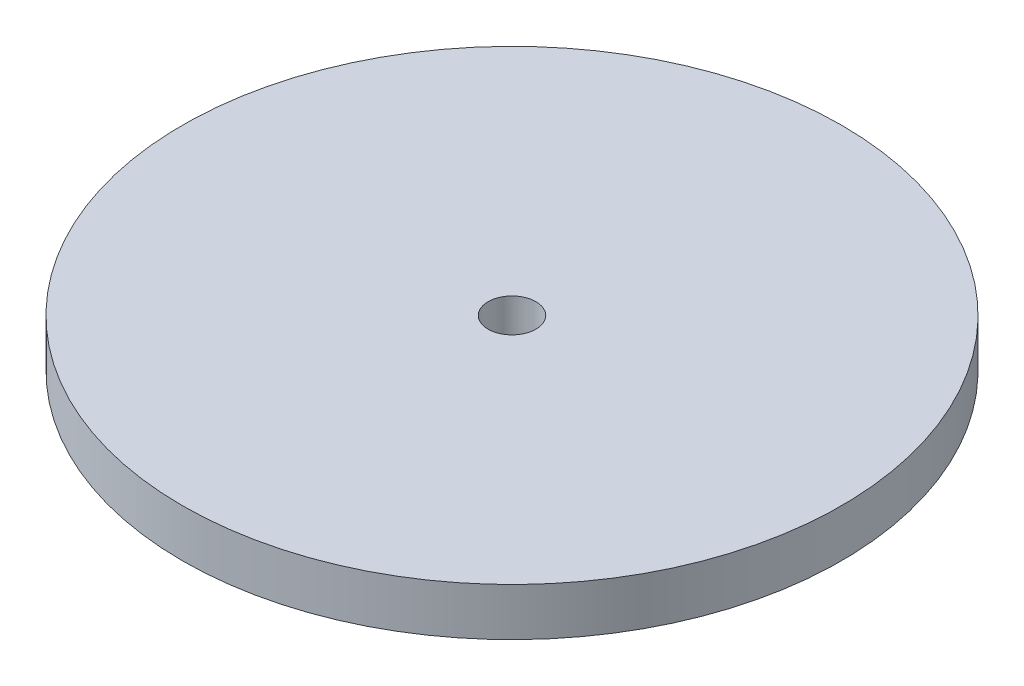
ISO-10303-21;
HEADER;
FILE_DESCRIPTION(('STEP AP214'),'2;1');
FILE_NAME('part.step','',(''),(''),'','','');
FILE_SCHEMA(('AUTOMOTIVE_DESIGN { 1 0 10303 214 1 1 1 1 }'));
ENDSEC;
DATA;
#1=APPLICATION_CONTEXT('core data for automotive mechanical design processes');
#2=APPLICATION_PROTOCOL_DEFINITION('international standard','automotive_design',2000,#1);
#3=PRODUCT_CONTEXT('',#1,'mechanical');
#4=PRODUCT('Part','Part','',(#3));
#5=PRODUCT_RELATED_PRODUCT_CATEGORY('part','',(#4));
#6=PRODUCT_DEFINITION_FORMATION('','',#4);
#7=PRODUCT_DEFINITION_CONTEXT('part definition',#1,'design');
#8=PRODUCT_DEFINITION('design','',#6,#7);
#9=PRODUCT_DEFINITION_SHAPE('','',#8);
#10=(LENGTH_UNIT() NAMED_UNIT(*) SI_UNIT(.MILLI.,.METRE.));
#11=(NAMED_UNIT(*) PLANE_ANGLE_UNIT() SI_UNIT($,.RADIAN.));
#12=(NAMED_UNIT(*) SI_UNIT($,.STERADIAN.) SOLID_ANGLE_UNIT());
#13=UNCERTAINTY_MEASURE_WITH_UNIT(LENGTH_MEASURE(1.E-05),#10,'distance_accuracy_value','');
#14=(GEOMETRIC_REPRESENTATION_CONTEXT(3) GLOBAL_UNCERTAINTY_ASSIGNED_CONTEXT((#13)) GLOBAL_UNIT_ASSIGNED_CONTEXT((#10,
#11,#12)) REPRESENTATION_CONTEXT('',''));
#15=CARTESIAN_POINT('',(0.,0.,0.));
#16=DIRECTION('',(0.,0.,1.));
#17=DIRECTION('',(1.,0.,0.));
#18=AXIS2_PLACEMENT_3D('',#15,#16,#17);
#19=CARTESIAN_POINT('',(0.,12.7,0.));
#20=DIRECTION('',(0.,-1.,0.));
#21=DIRECTION('',(0.,0.,-1.));
#22=AXIS2_PLACEMENT_3D('',#19,#20,#21);
#23=CYLINDRICAL_SURFACE('',#22,87.63);
#24=CARTESIAN_POINT('',(0.,12.7,0.));
#25=DIRECTION('',(0.,1.,0.));
#26=DIRECTION('',(0.,0.,1.));
#27=AXIS2_PLACEMENT_3D('',#24,#25,#26);
#28=CIRCLE('',#27,87.63);
#29=CARTESIAN_POINT('',(0.,12.7,87.63));
#30=VERTEX_POINT('',#29);
#31=EDGE_CURVE('E10',#30,#30,#28,.T.);
#32=ORIENTED_EDGE('',*,*,#31,.F.);
#33=EDGE_LOOP('',(#32));
#34=FACE_BOUND('',#33,.T.);
#35=CARTESIAN_POINT('',(0.,0.,0.));
#36=DIRECTION('',(0.,1.,0.));
#37=DIRECTION('',(0.,0.,1.));
#38=AXIS2_PLACEMENT_3D('',#35,#36,#37);
#39=CIRCLE('',#38,87.63);
#40=CARTESIAN_POINT('',(0.,0.,87.63));
#41=VERTEX_POINT('',#40);
#42=EDGE_CURVE('E34',#41,#41,#39,.T.);
#43=ORIENTED_EDGE('',*,*,#42,.T.);
#44=EDGE_LOOP('',(#43));
#45=FACE_BOUND('',#44,.T.);
#46=ADVANCED_FACE('F31',(#34,#45),#23,.T.);
#47=CARTESIAN_POINT('',(0.,12.7,0.));
#48=DIRECTION('',(0.,1.,0.));
#49=DIRECTION('',(0.,0.,1.));
#50=AXIS2_PLACEMENT_3D('',#47,#48,#49);
#51=PLANE('',#50);
#52=CARTESIAN_POINT('',(0.,12.7,0.));
#53=DIRECTION('',(0.,1.,0.));
#54=DIRECTION('',(0.,0.,1.));
#55=AXIS2_PLACEMENT_3D('',#52,#53,#54);
#56=CIRCLE('',#55,6.35);
#57=CARTESIAN_POINT('',(0.,12.7,6.35));
#58=VERTEX_POINT('',#57);
#59=EDGE_CURVE('E43',#58,#58,#56,.T.);
#60=ORIENTED_EDGE('',*,*,#59,.F.);
#61=EDGE_LOOP('',(#60));
#62=FACE_BOUND('',#61,.T.);
#63=ORIENTED_EDGE('',*,*,#31,.T.);
#64=EDGE_LOOP('',(#63));
#65=FACE_BOUND('',#64,.T.);
#66=ADVANCED_FACE('F58',(#62,#65),#51,.T.);
#67=CARTESIAN_POINT('',(0.,0.,0.));
#68=DIRECTION('',(0.,1.,0.));
#69=DIRECTION('',(0.,0.,1.));
#70=AXIS2_PLACEMENT_3D('',#67,#68,#69);
#71=PLANE('',#70);
#72=CARTESIAN_POINT('',(0.,0.,0.));
#73=DIRECTION('',(0.,1.,0.));
#74=DIRECTION('',(0.,0.,1.));
#75=AXIS2_PLACEMENT_3D('',#72,#73,#74);
#76=CIRCLE('',#75,6.35);
#77=CARTESIAN_POINT('',(0.,0.,6.35));
#78=VERTEX_POINT('',#77);
#79=EDGE_CURVE('E41',#78,#78,#76,.T.);
#80=ORIENTED_EDGE('',*,*,#79,.T.);
#81=EDGE_LOOP('',(#80));
#82=FACE_BOUND('',#81,.T.);
#83=ORIENTED_EDGE('',*,*,#42,.F.);
#84=EDGE_LOOP('',(#83));
#85=FACE_BOUND('',#84,.T.);
#86=ADVANCED_FACE('F49',(#82,#85),#71,.F.);
#87=CARTESIAN_POINT('',(0.,0.,0.));
#88=DIRECTION('',(0.,1.,0.));
#89=DIRECTION('',(0.,0.,1.));
#90=AXIS2_PLACEMENT_3D('',#87,#88,#89);
#91=CYLINDRICAL_SURFACE('',#90,6.35);
#92=ORIENTED_EDGE('',*,*,#79,.F.);
#93=EDGE_LOOP('',(#92));
#94=FACE_BOUND('',#93,.T.);
#95=ORIENTED_EDGE('',*,*,#59,.T.);
#96=EDGE_LOOP('',(#95));
#97=FACE_BOUND('',#96,.T.);
#98=ADVANCED_FACE('F52',(#94,#97),#91,.F.);
#99=CLOSED_SHELL('',(#46,#66,#86,#98));
#100=MANIFOLD_SOLID_BREP('B2',#99);
#101=ADVANCED_BREP_SHAPE_REPRESENTATION('',(#18,#100),#14);
#102=SHAPE_DEFINITION_REPRESENTATION(#9,#101);
ENDSEC;
END-ISO-10303-21;
